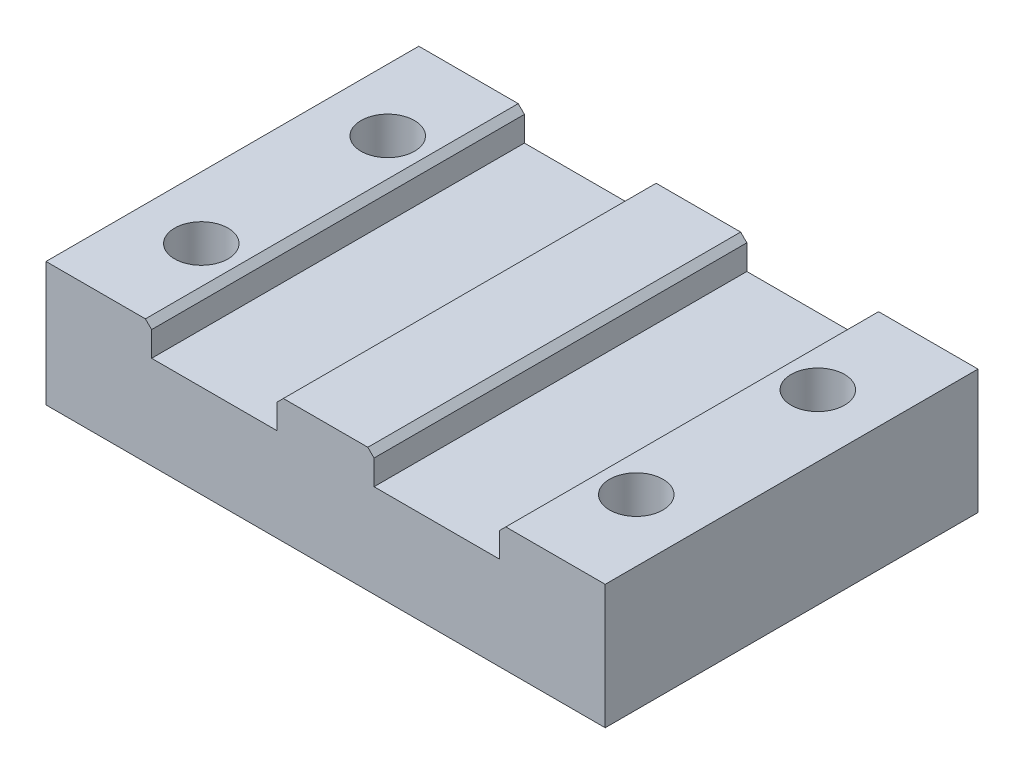
ISO-10303-21;
HEADER;
FILE_DESCRIPTION(('STEP AP214'),'2;1');
FILE_NAME('part.step','',(''),(''),'','','');
FILE_SCHEMA(('AUTOMOTIVE_DESIGN { 1 0 10303 214 1 1 1 1 }'));
ENDSEC;
DATA;
#1=APPLICATION_CONTEXT('core data for automotive mechanical design processes');
#2=APPLICATION_PROTOCOL_DEFINITION('international standard','automotive_design',2000,#1);
#3=PRODUCT_CONTEXT('',#1,'mechanical');
#4=PRODUCT('Part','Part','',(#3));
#5=PRODUCT_RELATED_PRODUCT_CATEGORY('part','',(#4));
#6=PRODUCT_DEFINITION_FORMATION('','',#4);
#7=PRODUCT_DEFINITION_CONTEXT('part definition',#1,'design');
#8=PRODUCT_DEFINITION('design','',#6,#7);
#9=PRODUCT_DEFINITION_SHAPE('','',#8);
#10=(LENGTH_UNIT() NAMED_UNIT(*) SI_UNIT(.MILLI.,.METRE.));
#11=(NAMED_UNIT(*) PLANE_ANGLE_UNIT() SI_UNIT($,.RADIAN.));
#12=(NAMED_UNIT(*) SI_UNIT($,.STERADIAN.) SOLID_ANGLE_UNIT());
#13=UNCERTAINTY_MEASURE_WITH_UNIT(LENGTH_MEASURE(1.E-05),#10,'distance_accuracy_value','');
#14=(GEOMETRIC_REPRESENTATION_CONTEXT(3) GLOBAL_UNCERTAINTY_ASSIGNED_CONTEXT((#13)) GLOBAL_UNIT_ASSIGNED_CONTEXT((#10,
#11,#12)) REPRESENTATION_CONTEXT('',''));
#15=CARTESIAN_POINT('',(0.,0.,0.));
#16=DIRECTION('',(0.,0.,1.));
#17=DIRECTION('',(1.,0.,0.));
#18=AXIS2_PLACEMENT_3D('',#15,#16,#17);
#19=CARTESIAN_POINT('',(-35.,20.,15.));
#20=DIRECTION('',(0.,-1.,0.));
#21=DIRECTION('',(0.,0.,-1.));
#22=AXIS2_PLACEMENT_3D('',#19,#20,#21);
#23=CYLINDRICAL_SURFACE('',#22,4.3);
#24=CARTESIAN_POINT('',(-35.,20.,15.));
#25=DIRECTION('',(0.,-1.,0.));
#26=DIRECTION('',(0.,0.,-1.));
#27=AXIS2_PLACEMENT_3D('',#24,#25,#26);
#28=CIRCLE('',#27,4.3);
#29=CARTESIAN_POINT('',(-35.,20.,10.7));
#30=VERTEX_POINT('',#29);
#31=EDGE_CURVE('E177',#30,#30,#28,.T.);
#32=ORIENTED_EDGE('',*,*,#31,.F.);
#33=EDGE_LOOP('',(#32));
#34=FACE_BOUND('',#33,.T.);
#35=CARTESIAN_POINT('',(-35.,10.,15.));
#36=DIRECTION('',(0.,-1.,0.));
#37=DIRECTION('',(0.,0.,-1.));
#38=AXIS2_PLACEMENT_3D('',#35,#36,#37);
#39=CIRCLE('',#38,4.3);
#40=CARTESIAN_POINT('',(-35.,10.,10.7));
#41=VERTEX_POINT('',#40);
#42=EDGE_CURVE('E253',#41,#41,#39,.F.);
#43=ORIENTED_EDGE('',*,*,#42,.F.);
#44=EDGE_LOOP('',(#43));
#45=FACE_BOUND('',#44,.T.);
#46=ADVANCED_FACE('F35',(#34,#45),#23,.F.);
#47=CARTESIAN_POINT('',(35.,20.,-14.2172732356869));
#48=DIRECTION('',(0.,-1.,0.));
#49=DIRECTION('',(0.,0.,-1.));
#50=AXIS2_PLACEMENT_3D('',#47,#48,#49);
#51=CYLINDRICAL_SURFACE('',#50,4.3);
#52=CARTESIAN_POINT('',(35.,20.,-14.2172732356869));
#53=DIRECTION('',(0.,-1.,0.));
#54=DIRECTION('',(0.,0.,-1.));
#55=AXIS2_PLACEMENT_3D('',#52,#53,#54);
#56=CIRCLE('',#55,4.3);
#57=CARTESIAN_POINT('',(35.,20.,-18.5172732356869));
#58=VERTEX_POINT('',#57);
#59=EDGE_CURVE('E612',#58,#58,#56,.T.);
#60=ORIENTED_EDGE('',*,*,#59,.F.);
#61=EDGE_LOOP('',(#60));
#62=FACE_BOUND('',#61,.T.);
#63=CARTESIAN_POINT('',(35.,10.,-14.2172732356869));
#64=DIRECTION('',(0.,-1.,0.));
#65=DIRECTION('',(0.,0.,-1.));
#66=AXIS2_PLACEMENT_3D('',#63,#64,#65);
#67=CIRCLE('',#66,4.3);
#68=CARTESIAN_POINT('',(35.,10.,-18.5172732356869));
#69=VERTEX_POINT('',#68);
#70=EDGE_CURVE('E249',#69,#69,#67,.F.);
#71=ORIENTED_EDGE('',*,*,#70,.F.);
#72=EDGE_LOOP('',(#71));
#73=FACE_BOUND('',#72,.T.);
#74=ADVANCED_FACE('F353',(#62,#73),#51,.F.);
#75=CARTESIAN_POINT('',(-35.,20.,-15.));
#76=DIRECTION('',(0.,-1.,0.));
#77=DIRECTION('',(0.,0.,-1.));
#78=AXIS2_PLACEMENT_3D('',#75,#76,#77);
#79=CYLINDRICAL_SURFACE('',#78,4.3);
#80=CARTESIAN_POINT('',(-35.,20.,-15.));
#81=DIRECTION('',(0.,-1.,0.));
#82=DIRECTION('',(0.,0.,-1.));
#83=AXIS2_PLACEMENT_3D('',#80,#81,#82);
#84=CIRCLE('',#83,4.3);
#85=CARTESIAN_POINT('',(-35.,20.,-19.3));
#86=VERTEX_POINT('',#85);
#87=EDGE_CURVE('E609',#86,#86,#84,.T.);
#88=ORIENTED_EDGE('',*,*,#87,.F.);
#89=EDGE_LOOP('',(#88));
#90=FACE_BOUND('',#89,.T.);
#91=CARTESIAN_POINT('',(-35.,10.,-15.));
#92=DIRECTION('',(0.,-1.,0.));
#93=DIRECTION('',(0.,0.,-1.));
#94=AXIS2_PLACEMENT_3D('',#91,#92,#93);
#95=CIRCLE('',#94,4.3);
#96=CARTESIAN_POINT('',(-35.,10.,-19.3));
#97=VERTEX_POINT('',#96);
#98=EDGE_CURVE('E246',#97,#97,#95,.F.);
#99=ORIENTED_EDGE('',*,*,#98,.F.);
#100=EDGE_LOOP('',(#99));
#101=FACE_BOUND('',#100,.T.);
#102=ADVANCED_FACE('F359',(#90,#101),#79,.F.);
#103=CARTESIAN_POINT('',(35.,20.,15.));
#104=DIRECTION('',(0.,-1.,0.));
#105=DIRECTION('',(0.,0.,-1.));
#106=AXIS2_PLACEMENT_3D('',#103,#104,#105);
#107=CYLINDRICAL_SURFACE('',#106,4.3);
#108=CARTESIAN_POINT('',(35.,20.,15.));
#109=DIRECTION('',(0.,-1.,0.));
#110=DIRECTION('',(0.,0.,-1.));
#111=AXIS2_PLACEMENT_3D('',#108,#109,#110);
#112=CIRCLE('',#111,4.3);
#113=CARTESIAN_POINT('',(35.,20.,10.7));
#114=VERTEX_POINT('',#113);
#115=EDGE_CURVE('E244',#114,#114,#112,.T.);
#116=ORIENTED_EDGE('',*,*,#115,.F.);
#117=EDGE_LOOP('',(#116));
#118=FACE_BOUND('',#117,.T.);
#119=CARTESIAN_POINT('',(35.,10.,15.));
#120=DIRECTION('',(0.,-1.,0.));
#121=DIRECTION('',(0.,0.,-1.));
#122=AXIS2_PLACEMENT_3D('',#119,#120,#121);
#123=CIRCLE('',#122,4.3);
#124=CARTESIAN_POINT('',(35.,10.,10.7));
#125=VERTEX_POINT('',#124);
#126=EDGE_CURVE('E241',#125,#125,#123,.F.);
#127=ORIENTED_EDGE('',*,*,#126,.F.);
#128=EDGE_LOOP('',(#127));
#129=FACE_BOUND('',#128,.T.);
#130=ADVANCED_FACE('F366',(#118,#129),#107,.F.);
#131=CARTESIAN_POINT('',(0.,20.,0.));
#132=DIRECTION('',(0.,1.,0.));
#133=DIRECTION('',(0.,0.,1.));
#134=AXIS2_PLACEMENT_3D('',#131,#132,#133);
#135=PLANE('',#134);
#136=ORIENTED_EDGE('',*,*,#59,.T.);
#137=EDGE_LOOP('',(#136));
#138=FACE_BOUND('',#137,.T.);
#139=ORIENTED_EDGE('',*,*,#115,.T.);
#140=EDGE_LOOP('',(#139));
#141=FACE_BOUND('',#140,.T.);
#142=DIRECTION('',(-1.,0.,0.));
#143=VECTOR('',#142,1.);
#144=CARTESIAN_POINT('',(45.,20.,-30.));
#145=LINE('',#144,#143);
#146=CARTESIAN_POINT('',(45.,20.,-30.));
#147=VERTEX_POINT('',#146);
#148=CARTESIAN_POINT('',(29.,20.,-30.));
#149=VERTEX_POINT('',#148);
#150=EDGE_CURVE('E217',#147,#149,#145,.T.);
#151=ORIENTED_EDGE('',*,*,#150,.T.);
#152=DIRECTION('',(0.,0.,1.));
#153=VECTOR('',#152,1.);
#154=CARTESIAN_POINT('',(29.,20.,30.));
#155=LINE('',#154,#153);
#156=CARTESIAN_POINT('',(29.,20.,30.));
#157=VERTEX_POINT('',#156);
#158=EDGE_CURVE('E11',#149,#157,#155,.T.);
#159=ORIENTED_EDGE('',*,*,#158,.T.);
#160=DIRECTION('',(1.,0.,0.));
#161=VECTOR('',#160,1.);
#162=CARTESIAN_POINT('',(45.,20.,30.));
#163=LINE('',#162,#161);
#164=CARTESIAN_POINT('',(45.,20.,30.));
#165=VERTEX_POINT('',#164);
#166=EDGE_CURVE('E208',#157,#165,#163,.T.);
#167=ORIENTED_EDGE('',*,*,#166,.T.);
#168=DIRECTION('',(0.,0.,-1.));
#169=VECTOR('',#168,1.);
#170=CARTESIAN_POINT('',(45.,20.,30.));
#171=LINE('',#170,#169);
#172=EDGE_CURVE('E213',#165,#147,#171,.T.);
#173=ORIENTED_EDGE('',*,*,#172,.T.);
#174=EDGE_LOOP('',(#151,#159,#167,#173));
#175=FACE_BOUND('',#174,.T.);
#176=ADVANCED_FACE('F305',(#138,#141,#175),#135,.T.);
#177=ORIENTED_EDGE('',*,*,#87,.T.);
#178=EDGE_LOOP('',(#177));
#179=FACE_BOUND('',#178,.T.);
#180=ORIENTED_EDGE('',*,*,#31,.T.);
#181=EDGE_LOOP('',(#180));
#182=FACE_BOUND('',#181,.T.);
#183=CARTESIAN_POINT('',(-45.,20.,30.));
#184=VERTEX_POINT('',#183);
#185=CARTESIAN_POINT('',(-29.,20.,30.));
#186=VERTEX_POINT('',#185);
#187=EDGE_CURVE('E210',#184,#186,#163,.T.);
#188=ORIENTED_EDGE('',*,*,#187,.T.);
#189=DIRECTION('',(0.,0.,-1.));
#190=VECTOR('',#189,1.);
#191=CARTESIAN_POINT('',(-29.,20.,-30.));
#192=LINE('',#191,#190);
#193=CARTESIAN_POINT('',(-29.,20.,-30.));
#194=VERTEX_POINT('',#193);
#195=EDGE_CURVE('E282',#186,#194,#192,.T.);
#196=ORIENTED_EDGE('',*,*,#195,.T.);
#197=CARTESIAN_POINT('',(-45.,20.,-30.));
#198=VERTEX_POINT('',#197);
#199=EDGE_CURVE('E216',#194,#198,#145,.T.);
#200=ORIENTED_EDGE('',*,*,#199,.T.);
#201=DIRECTION('',(0.,0.,1.));
#202=VECTOR('',#201,1.);
#203=CARTESIAN_POINT('',(-45.,20.,30.));
#204=LINE('',#203,#202);
#205=EDGE_CURVE('E205',#198,#184,#204,.T.);
#206=ORIENTED_EDGE('',*,*,#205,.T.);
#207=EDGE_LOOP('',(#188,#196,#200,#206));
#208=FACE_BOUND('',#207,.T.);
#209=ADVANCED_FACE('F379',(#179,#182,#208),#135,.T.);
#210=CARTESIAN_POINT('',(-45.,20.,30.));
#211=DIRECTION('',(1.,0.,0.));
#212=DIRECTION('',(0.,0.,-1.));
#213=AXIS2_PLACEMENT_3D('',#210,#211,#212);
#214=PLANE('',#213);
#215=DIRECTION('',(0.,0.,1.));
#216=VECTOR('',#215,1.);
#217=CARTESIAN_POINT('',(-45.,0.,30.));
#218=LINE('',#217,#216);
#219=CARTESIAN_POINT('',(-45.,0.,-30.));
#220=VERTEX_POINT('',#219);
#221=CARTESIAN_POINT('',(-45.,0.,30.));
#222=VERTEX_POINT('',#221);
#223=EDGE_CURVE('E200',#220,#222,#218,.T.);
#224=ORIENTED_EDGE('',*,*,#223,.T.);
#225=DIRECTION('',(0.,-1.,0.));
#226=VECTOR('',#225,1.);
#227=CARTESIAN_POINT('',(-45.,20.,30.));
#228=LINE('',#227,#226);
#229=EDGE_CURVE('E237',#184,#222,#228,.T.);
#230=ORIENTED_EDGE('',*,*,#229,.F.);
#231=ORIENTED_EDGE('',*,*,#205,.F.);
#232=DIRECTION('',(0.,-1.,0.));
#233=VECTOR('',#232,1.);
#234=CARTESIAN_POINT('',(-45.,20.,-30.));
#235=LINE('',#234,#233);
#236=EDGE_CURVE('E220',#198,#220,#235,.T.);
#237=ORIENTED_EDGE('',*,*,#236,.T.);
#238=EDGE_LOOP('',(#224,#230,#231,#237));
#239=FACE_BOUND('',#238,.T.);
#240=ADVANCED_FACE('F317',(#239),#214,.F.);
#241=CARTESIAN_POINT('',(45.,20.,30.));
#242=DIRECTION('',(0.,0.,-1.));
#243=DIRECTION('',(-1.,0.,0.));
#244=AXIS2_PLACEMENT_3D('',#241,#242,#243);
#245=PLANE('',#244);
#246=CARTESIAN_POINT('',(-6.79999999999997,20.,30.));
#247=VERTEX_POINT('',#246);
#248=CARTESIAN_POINT('',(6.80000000000004,20.,30.));
#249=VERTEX_POINT('',#248);
#250=EDGE_CURVE('E214',#247,#249,#163,.T.);
#251=ORIENTED_EDGE('',*,*,#250,.F.);
#252=DIRECTION('',(-0.707106781186548,-0.707106781186548,0.));
#253=VECTOR('',#252,1.);
#254=CARTESIAN_POINT('',(-6.79999999999998,20.,30.));
#255=LINE('',#254,#253);
#256=CARTESIAN_POINT('',(-7.79999999999999,19.,30.));
#257=VERTEX_POINT('',#256);
#258=EDGE_CURVE('E267',#247,#257,#255,.T.);
#259=ORIENTED_EDGE('',*,*,#258,.T.);
#260=DIRECTION('',(0.,1.,0.));
#261=VECTOR('',#260,1.);
#262=CARTESIAN_POINT('',(-7.8,20.,30.));
#263=LINE('',#262,#261);
#264=CARTESIAN_POINT('',(-7.79999999999999,15.,30.));
#265=VERTEX_POINT('',#264);
#266=EDGE_CURVE('E189',#265,#257,#263,.T.);
#267=ORIENTED_EDGE('',*,*,#266,.F.);
#268=DIRECTION('',(1.,0.,0.));
#269=VECTOR('',#268,1.);
#270=CARTESIAN_POINT('',(-7.79999999999999,15.,30.));
#271=LINE('',#270,#269);
#272=CARTESIAN_POINT('',(-28.,15.,30.));
#273=VERTEX_POINT('',#272);
#274=EDGE_CURVE('E155',#273,#265,#271,.T.);
#275=ORIENTED_EDGE('',*,*,#274,.F.);
#276=DIRECTION('',(0.,-1.,0.));
#277=VECTOR('',#276,1.);
#278=CARTESIAN_POINT('',(-28.,25.,30.));
#279=LINE('',#278,#277);
#280=CARTESIAN_POINT('',(-28.,19.,30.));
#281=VERTEX_POINT('',#280);
#282=EDGE_CURVE('E172',#281,#273,#279,.T.);
#283=ORIENTED_EDGE('',*,*,#282,.F.);
#284=DIRECTION('',(-0.707106781186548,0.707106781186548,0.));
#285=VECTOR('',#284,1.);
#286=CARTESIAN_POINT('',(-28.,19.,30.));
#287=LINE('',#286,#285);
#288=EDGE_CURVE('E263',#281,#186,#287,.T.);
#289=ORIENTED_EDGE('',*,*,#288,.T.);
#290=ORIENTED_EDGE('',*,*,#187,.F.);
#291=ORIENTED_EDGE('',*,*,#229,.T.);
#292=DIRECTION('',(1.,0.,0.));
#293=VECTOR('',#292,1.);
#294=CARTESIAN_POINT('',(45.,0.,30.));
#295=LINE('',#294,#293);
#296=CARTESIAN_POINT('',(45.,0.,30.));
#297=VERTEX_POINT('',#296);
#298=EDGE_CURVE('E224',#222,#297,#295,.T.);
#299=ORIENTED_EDGE('',*,*,#298,.T.);
#300=DIRECTION('',(0.,-1.,0.));
#301=VECTOR('',#300,1.);
#302=CARTESIAN_POINT('',(45.,20.,30.));
#303=LINE('',#302,#301);
#304=EDGE_CURVE('E234',#165,#297,#303,.T.);
#305=ORIENTED_EDGE('',*,*,#304,.F.);
#306=ORIENTED_EDGE('',*,*,#166,.F.);
#307=DIRECTION('',(-0.707106781186544,-0.707106781186551,0.));
#308=VECTOR('',#307,1.);
#309=CARTESIAN_POINT('',(28.,19.,30.));
#310=LINE('',#309,#308);
#311=CARTESIAN_POINT('',(28.,19.,30.));
#312=VERTEX_POINT('',#311);
#313=EDGE_CURVE('E261',#157,#312,#310,.T.);
#314=ORIENTED_EDGE('',*,*,#313,.T.);
#315=DIRECTION('',(0.,1.,0.));
#316=VECTOR('',#315,1.);
#317=CARTESIAN_POINT('',(28.,25.,30.));
#318=LINE('',#317,#316);
#319=CARTESIAN_POINT('',(28.,15.,30.));
#320=VERTEX_POINT('',#319);
#321=EDGE_CURVE('E174',#320,#312,#318,.T.);
#322=ORIENTED_EDGE('',*,*,#321,.F.);
#323=DIRECTION('',(1.,0.,0.));
#324=VECTOR('',#323,1.);
#325=CARTESIAN_POINT('',(28.,15.,30.));
#326=LINE('',#325,#324);
#327=CARTESIAN_POINT('',(7.80000000000001,15.,30.));
#328=VERTEX_POINT('',#327);
#329=EDGE_CURVE('E193',#328,#320,#326,.T.);
#330=ORIENTED_EDGE('',*,*,#329,.F.);
#331=DIRECTION('',(0.,-1.,0.));
#332=VECTOR('',#331,1.);
#333=CARTESIAN_POINT('',(7.80000000000001,15.,30.));
#334=LINE('',#333,#332);
#335=CARTESIAN_POINT('',(7.80000000000001,19.,30.));
#336=VERTEX_POINT('',#335);
#337=EDGE_CURVE('E191',#336,#328,#334,.T.);
#338=ORIENTED_EDGE('',*,*,#337,.F.);
#339=DIRECTION('',(-0.707106781186543,0.707106781186552,0.));
#340=VECTOR('',#339,1.);
#341=CARTESIAN_POINT('',(7.80000000000001,19.,30.));
#342=LINE('',#341,#340);
#343=EDGE_CURVE('E265',#336,#249,#342,.T.);
#344=ORIENTED_EDGE('',*,*,#343,.T.);
#345=EDGE_LOOP('',(#251,#259,#267,#275,#283,#289,#290,#291,#299,#305,#306,#314,#322,#330,#338,#344));
#346=FACE_BOUND('',#345,.T.);
#347=ADVANCED_FACE('F300',(#346),#245,.F.);
#348=CARTESIAN_POINT('',(45.,20.,30.));
#349=DIRECTION('',(-1.,0.,0.));
#350=DIRECTION('',(0.,0.,1.));
#351=AXIS2_PLACEMENT_3D('',#348,#349,#350);
#352=PLANE('',#351);
#353=DIRECTION('',(0.,0.,-1.));
#354=VECTOR('',#353,1.);
#355=CARTESIAN_POINT('',(45.,0.,30.));
#356=LINE('',#355,#354);
#357=CARTESIAN_POINT('',(45.,0.,-30.));
#358=VERTEX_POINT('',#357);
#359=EDGE_CURVE('E226',#297,#358,#356,.T.);
#360=ORIENTED_EDGE('',*,*,#359,.T.);
#361=DIRECTION('',(0.,-1.,0.));
#362=VECTOR('',#361,1.);
#363=CARTESIAN_POINT('',(45.,20.,-30.));
#364=LINE('',#363,#362);
#365=EDGE_CURVE('E231',#147,#358,#364,.T.);
#366=ORIENTED_EDGE('',*,*,#365,.F.);
#367=ORIENTED_EDGE('',*,*,#172,.F.);
#368=ORIENTED_EDGE('',*,*,#304,.T.);
#369=EDGE_LOOP('',(#360,#366,#367,#368));
#370=FACE_BOUND('',#369,.T.);
#371=ADVANCED_FACE('F385',(#370),#352,.F.);
#372=CARTESIAN_POINT('',(45.,20.,-30.));
#373=DIRECTION('',(0.,0.,1.));
#374=DIRECTION('',(1.,0.,0.));
#375=AXIS2_PLACEMENT_3D('',#372,#373,#374);
#376=PLANE('',#375);
#377=DIRECTION('',(0.,1.,0.));
#378=VECTOR('',#377,1.);
#379=CARTESIAN_POINT('',(-7.8,20.,-30.));
#380=LINE('',#379,#378);
#381=CARTESIAN_POINT('',(-7.79999999999999,15.,-30.));
#382=VERTEX_POINT('',#381);
#383=CARTESIAN_POINT('',(-7.79999999999999,19.,-30.));
#384=VERTEX_POINT('',#383);
#385=EDGE_CURVE('E163',#382,#384,#380,.T.);
#386=ORIENTED_EDGE('',*,*,#385,.T.);
#387=DIRECTION('',(0.707106781186548,0.707106781186548,0.));
#388=VECTOR('',#387,1.);
#389=CARTESIAN_POINT('',(-6.79999999999998,20.,-30.));
#390=LINE('',#389,#388);
#391=CARTESIAN_POINT('',(-6.79999999999997,20.,-30.));
#392=VERTEX_POINT('',#391);
#393=EDGE_CURVE('E274',#384,#392,#390,.T.);
#394=ORIENTED_EDGE('',*,*,#393,.T.);
#395=CARTESIAN_POINT('',(6.80000000000004,20.,-30.));
#396=VERTEX_POINT('',#395);
#397=EDGE_CURVE('E221',#396,#392,#145,.T.);
#398=ORIENTED_EDGE('',*,*,#397,.F.);
#399=DIRECTION('',(0.707106781186543,-0.707106781186552,0.));
#400=VECTOR('',#399,1.);
#401=CARTESIAN_POINT('',(7.80000000000001,19.,-30.));
#402=LINE('',#401,#400);
#403=CARTESIAN_POINT('',(7.80000000000001,19.,-30.));
#404=VERTEX_POINT('',#403);
#405=EDGE_CURVE('E50',#396,#404,#402,.T.);
#406=ORIENTED_EDGE('',*,*,#405,.T.);
#407=DIRECTION('',(0.,-1.,0.));
#408=VECTOR('',#407,1.);
#409=CARTESIAN_POINT('',(7.80000000000001,15.,-30.));
#410=LINE('',#409,#408);
#411=CARTESIAN_POINT('',(7.80000000000001,15.,-30.));
#412=VERTEX_POINT('',#411);
#413=EDGE_CURVE('E168',#404,#412,#410,.T.);
#414=ORIENTED_EDGE('',*,*,#413,.T.);
#415=DIRECTION('',(1.,0.,0.));
#416=VECTOR('',#415,1.);
#417=CARTESIAN_POINT('',(28.,15.,-30.));
#418=LINE('',#417,#416);
#419=CARTESIAN_POINT('',(28.,15.,-30.));
#420=VERTEX_POINT('',#419);
#421=EDGE_CURVE('E181',#412,#420,#418,.T.);
#422=ORIENTED_EDGE('',*,*,#421,.T.);
#423=DIRECTION('',(0.,1.,0.));
#424=VECTOR('',#423,1.);
#425=CARTESIAN_POINT('',(28.,25.,-30.));
#426=LINE('',#425,#424);
#427=CARTESIAN_POINT('',(28.,19.,-30.));
#428=VERTEX_POINT('',#427);
#429=EDGE_CURVE('E184',#420,#428,#426,.T.);
#430=ORIENTED_EDGE('',*,*,#429,.T.);
#431=DIRECTION('',(0.707106781186544,0.707106781186551,0.));
#432=VECTOR('',#431,1.);
#433=CARTESIAN_POINT('',(28.,19.,-30.));
#434=LINE('',#433,#432);
#435=EDGE_CURVE('E270',#428,#149,#434,.T.);
#436=ORIENTED_EDGE('',*,*,#435,.T.);
#437=ORIENTED_EDGE('',*,*,#150,.F.);
#438=ORIENTED_EDGE('',*,*,#365,.T.);
#439=DIRECTION('',(-1.,0.,0.));
#440=VECTOR('',#439,1.);
#441=CARTESIAN_POINT('',(45.,0.,-30.));
#442=LINE('',#441,#440);
#443=EDGE_CURVE('E209',#358,#220,#442,.T.);
#444=ORIENTED_EDGE('',*,*,#443,.T.);
#445=ORIENTED_EDGE('',*,*,#236,.F.);
#446=ORIENTED_EDGE('',*,*,#199,.F.);
#447=DIRECTION('',(0.707106781186548,-0.707106781186548,0.));
#448=VECTOR('',#447,1.);
#449=CARTESIAN_POINT('',(-28.,19.,-30.));
#450=LINE('',#449,#448);
#451=CARTESIAN_POINT('',(-28.,19.,-30.));
#452=VERTEX_POINT('',#451);
#453=EDGE_CURVE('E57',#194,#452,#450,.T.);
#454=ORIENTED_EDGE('',*,*,#453,.T.);
#455=DIRECTION('',(0.,-1.,0.));
#456=VECTOR('',#455,1.);
#457=CARTESIAN_POINT('',(-28.,25.,-30.));
#458=LINE('',#457,#456);
#459=CARTESIAN_POINT('',(-28.,15.,-30.));
#460=VERTEX_POINT('',#459);
#461=EDGE_CURVE('E160',#452,#460,#458,.T.);
#462=ORIENTED_EDGE('',*,*,#461,.T.);
#463=DIRECTION('',(1.,0.,0.));
#464=VECTOR('',#463,1.);
#465=CARTESIAN_POINT('',(-7.79999999999999,15.,-30.));
#466=LINE('',#465,#464);
#467=EDGE_CURVE('E153',#460,#382,#466,.T.);
#468=ORIENTED_EDGE('',*,*,#467,.T.);
#469=EDGE_LOOP('',(#386,#394,#398,#406,#414,#422,#430,#436,#437,#438,#444,#445,#446,#454,#462,#468));
#470=FACE_BOUND('',#469,.T.);
#471=ADVANCED_FACE('F170',(#470),#376,.F.);
#472=ORIENTED_EDGE('',*,*,#397,.T.);
#473=DIRECTION('',(0.,0.,1.));
#474=VECTOR('',#473,1.);
#475=CARTESIAN_POINT('',(-6.79999999999998,20.,30.));
#476=LINE('',#475,#474);
#477=EDGE_CURVE('E258',#392,#247,#476,.T.);
#478=ORIENTED_EDGE('',*,*,#477,.T.);
#479=ORIENTED_EDGE('',*,*,#250,.T.);
#480=DIRECTION('',(0.,0.,-1.));
#481=VECTOR('',#480,1.);
#482=CARTESIAN_POINT('',(6.80000000000002,20.,-30.));
#483=LINE('',#482,#481);
#484=EDGE_CURVE('E240',#249,#396,#483,.T.);
#485=ORIENTED_EDGE('',*,*,#484,.T.);
#486=EDGE_LOOP('',(#472,#478,#479,#485));
#487=FACE_BOUND('',#486,.T.);
#488=ADVANCED_FACE('F332',(#487),#135,.T.);
#489=CARTESIAN_POINT('',(0.,0.,0.));
#490=DIRECTION('',(0.,1.,0.));
#491=DIRECTION('',(0.,0.,1.));
#492=AXIS2_PLACEMENT_3D('',#489,#490,#491);
#493=PLANE('',#492);
#494=CARTESIAN_POINT('',(35.,0.,-14.2172732356869));
#495=DIRECTION('',(0.,-1.,0.));
#496=DIRECTION('',(0.,0.,-1.));
#497=AXIS2_PLACEMENT_3D('',#494,#495,#496);
#498=CIRCLE('',#497,8.8);
#499=CARTESIAN_POINT('',(35.,0.,-23.0172732356869));
#500=VERTEX_POINT('',#499);
#501=EDGE_CURVE('E640',#500,#500,#498,.T.);
#502=ORIENTED_EDGE('',*,*,#501,.F.);
#503=EDGE_LOOP('',(#502));
#504=FACE_BOUND('',#503,.T.);
#505=CARTESIAN_POINT('',(-35.,0.,15.));
#506=DIRECTION('',(0.,-1.,0.));
#507=DIRECTION('',(0.,0.,-1.));
#508=AXIS2_PLACEMENT_3D('',#505,#506,#507);
#509=CIRCLE('',#508,8.8);
#510=CARTESIAN_POINT('',(-35.,0.,6.2));
#511=VERTEX_POINT('',#510);
#512=EDGE_CURVE('E634',#511,#511,#509,.T.);
#513=ORIENTED_EDGE('',*,*,#512,.F.);
#514=EDGE_LOOP('',(#513));
#515=FACE_BOUND('',#514,.T.);
#516=CARTESIAN_POINT('',(-35.,0.,-15.));
#517=DIRECTION('',(0.,-1.,0.));
#518=DIRECTION('',(0.,0.,-1.));
#519=AXIS2_PLACEMENT_3D('',#516,#517,#518);
#520=CIRCLE('',#519,8.8);
#521=CARTESIAN_POINT('',(-35.,0.,-23.8));
#522=VERTEX_POINT('',#521);
#523=EDGE_CURVE('E628',#522,#522,#520,.T.);
#524=ORIENTED_EDGE('',*,*,#523,.F.);
#525=EDGE_LOOP('',(#524));
#526=FACE_BOUND('',#525,.T.);
#527=CARTESIAN_POINT('',(35.,0.,15.));
#528=DIRECTION('',(0.,-1.,0.));
#529=DIRECTION('',(0.,0.,-1.));
#530=AXIS2_PLACEMENT_3D('',#527,#528,#529);
#531=CIRCLE('',#530,8.8);
#532=CARTESIAN_POINT('',(35.,0.,6.2));
#533=VERTEX_POINT('',#532);
#534=EDGE_CURVE('E256',#533,#533,#531,.T.);
#535=ORIENTED_EDGE('',*,*,#534,.F.);
#536=EDGE_LOOP('',(#535));
#537=FACE_BOUND('',#536,.T.);
#538=ORIENTED_EDGE('',*,*,#223,.F.);
#539=ORIENTED_EDGE('',*,*,#443,.F.);
#540=ORIENTED_EDGE('',*,*,#359,.F.);
#541=ORIENTED_EDGE('',*,*,#298,.F.);
#542=EDGE_LOOP('',(#538,#539,#540,#541));
#543=FACE_BOUND('',#542,.T.);
#544=ADVANCED_FACE('F314',(#504,#515,#526,#537,#543),#493,.F.);
#545=CARTESIAN_POINT('',(-7.8,20.,-30.));
#546=DIRECTION('',(1.,0.,0.));
#547=DIRECTION('',(0.,1.,0.));
#548=AXIS2_PLACEMENT_3D('',#545,#546,#547);
#549=PLANE('',#548);
#550=ORIENTED_EDGE('',*,*,#266,.T.);
#551=DIRECTION('',(0.,0.,-1.));
#552=VECTOR('',#551,1.);
#553=CARTESIAN_POINT('',(-7.79999999999999,19.,-30.));
#554=LINE('',#553,#552);
#555=EDGE_CURVE('E166',#257,#384,#554,.T.);
#556=ORIENTED_EDGE('',*,*,#555,.T.);
#557=ORIENTED_EDGE('',*,*,#385,.F.);
#558=DIRECTION('',(0.,0.,1.));
#559=VECTOR('',#558,1.);
#560=CARTESIAN_POINT('',(-7.79999999999999,15.,-30.));
#561=LINE('',#560,#559);
#562=EDGE_CURVE('E148',#382,#265,#561,.T.);
#563=ORIENTED_EDGE('',*,*,#562,.T.);
#564=EDGE_LOOP('',(#550,#556,#557,#563));
#565=FACE_BOUND('',#564,.T.);
#566=ADVANCED_FACE('F164',(#565),#549,.F.);
#567=CARTESIAN_POINT('',(-28.,25.,-30.));
#568=DIRECTION('',(-1.,0.,0.));
#569=DIRECTION('',(0.,-1.,0.));
#570=AXIS2_PLACEMENT_3D('',#567,#568,#569);
#571=PLANE('',#570);
#572=ORIENTED_EDGE('',*,*,#461,.F.);
#573=DIRECTION('',(0.,0.,1.));
#574=VECTOR('',#573,1.);
#575=CARTESIAN_POINT('',(-28.,19.,30.));
#576=LINE('',#575,#574);
#577=EDGE_CURVE('E279',#452,#281,#576,.T.);
#578=ORIENTED_EDGE('',*,*,#577,.T.);
#579=ORIENTED_EDGE('',*,*,#282,.T.);
#580=DIRECTION('',(0.,0.,1.));
#581=VECTOR('',#580,1.);
#582=CARTESIAN_POINT('',(-28.,15.,-30.));
#583=LINE('',#582,#581);
#584=EDGE_CURVE('E198',#460,#273,#583,.T.);
#585=ORIENTED_EDGE('',*,*,#584,.F.);
#586=EDGE_LOOP('',(#572,#578,#579,#585));
#587=FACE_BOUND('',#586,.T.);
#588=ADVANCED_FACE('F326',(#587),#571,.F.);
#589=CARTESIAN_POINT('',(-7.79999999999999,15.,-30.));
#590=DIRECTION('',(0.,-1.,0.));
#591=DIRECTION('',(0.,0.,-1.));
#592=AXIS2_PLACEMENT_3D('',#589,#590,#591);
#593=PLANE('',#592);
#594=ORIENTED_EDGE('',*,*,#274,.T.);
#595=ORIENTED_EDGE('',*,*,#562,.F.);
#596=ORIENTED_EDGE('',*,*,#467,.F.);
#597=ORIENTED_EDGE('',*,*,#584,.T.);
#598=EDGE_LOOP('',(#594,#595,#596,#597));
#599=FACE_BOUND('',#598,.T.);
#600=ADVANCED_FACE('F150',(#599),#593,.F.);
#601=CARTESIAN_POINT('',(28.,25.,-30.));
#602=DIRECTION('',(1.,0.,0.));
#603=DIRECTION('',(0.,1.,0.));
#604=AXIS2_PLACEMENT_3D('',#601,#602,#603);
#605=PLANE('',#604);
#606=ORIENTED_EDGE('',*,*,#321,.T.);
#607=DIRECTION('',(0.,0.,-1.));
#608=VECTOR('',#607,1.);
#609=CARTESIAN_POINT('',(28.,19.,-30.));
#610=LINE('',#609,#608);
#611=EDGE_CURVE('E43',#312,#428,#610,.T.);
#612=ORIENTED_EDGE('',*,*,#611,.T.);
#613=ORIENTED_EDGE('',*,*,#429,.F.);
#614=DIRECTION('',(0.,0.,1.));
#615=VECTOR('',#614,1.);
#616=CARTESIAN_POINT('',(28.,15.,-30.));
#617=LINE('',#616,#615);
#618=EDGE_CURVE('E201',#420,#320,#617,.T.);
#619=ORIENTED_EDGE('',*,*,#618,.T.);
#620=EDGE_LOOP('',(#606,#612,#613,#619));
#621=FACE_BOUND('',#620,.T.);
#622=ADVANCED_FACE('F287',(#621),#605,.F.);
#623=CARTESIAN_POINT('',(28.,15.,-30.));
#624=DIRECTION('',(0.,-1.,0.));
#625=DIRECTION('',(1.,0.,0.));
#626=AXIS2_PLACEMENT_3D('',#623,#624,#625);
#627=PLANE('',#626);
#628=ORIENTED_EDGE('',*,*,#329,.T.);
#629=ORIENTED_EDGE('',*,*,#618,.F.);
#630=ORIENTED_EDGE('',*,*,#421,.F.);
#631=DIRECTION('',(0.,0.,1.));
#632=VECTOR('',#631,1.);
#633=CARTESIAN_POINT('',(7.80000000000001,15.,-30.));
#634=LINE('',#633,#632);
#635=EDGE_CURVE('E159',#412,#328,#634,.T.);
#636=ORIENTED_EDGE('',*,*,#635,.T.);
#637=EDGE_LOOP('',(#628,#629,#630,#636));
#638=FACE_BOUND('',#637,.T.);
#639=ADVANCED_FACE('F295',(#638),#627,.F.);
#640=CARTESIAN_POINT('',(7.80000000000001,15.,-30.));
#641=DIRECTION('',(-1.,0.,0.));
#642=DIRECTION('',(0.,-1.,0.));
#643=AXIS2_PLACEMENT_3D('',#640,#641,#642);
#644=PLANE('',#643);
#645=ORIENTED_EDGE('',*,*,#413,.F.);
#646=DIRECTION('',(0.,0.,1.));
#647=VECTOR('',#646,1.);
#648=CARTESIAN_POINT('',(7.80000000000001,19.,30.));
#649=LINE('',#648,#647);
#650=EDGE_CURVE('E276',#404,#336,#649,.T.);
#651=ORIENTED_EDGE('',*,*,#650,.T.);
#652=ORIENTED_EDGE('',*,*,#337,.T.);
#653=ORIENTED_EDGE('',*,*,#635,.F.);
#654=EDGE_LOOP('',(#645,#651,#652,#653));
#655=FACE_BOUND('',#654,.T.);
#656=ADVANCED_FACE('F339',(#655),#644,.F.);
#657=CARTESIAN_POINT('',(35.,10.,15.));
#658=DIRECTION('',(0.,-1.,0.));
#659=DIRECTION('',(0.,0.,-1.));
#660=AXIS2_PLACEMENT_3D('',#657,#658,#659);
#661=PLANE('',#660);
#662=CARTESIAN_POINT('',(35.,10.,15.));
#663=DIRECTION('',(0.,-1.,0.));
#664=DIRECTION('',(0.,0.,-1.));
#665=AXIS2_PLACEMENT_3D('',#662,#663,#664);
#666=CIRCLE('',#665,8.8);
#667=CARTESIAN_POINT('',(35.,10.,6.2));
#668=VERTEX_POINT('',#667);
#669=EDGE_CURVE('E245',#668,#668,#666,.T.);
#670=ORIENTED_EDGE('',*,*,#669,.T.);
#671=EDGE_LOOP('',(#670));
#672=FACE_BOUND('',#671,.T.);
#673=ORIENTED_EDGE('',*,*,#126,.T.);
#674=EDGE_LOOP('',(#673));
#675=FACE_BOUND('',#674,.T.);
#676=ADVANCED_FACE('F341',(#672,#675),#661,.T.);
#677=CARTESIAN_POINT('',(35.,10.,15.));
#678=DIRECTION('',(0.,-1.,0.));
#679=DIRECTION('',(0.,0.,-1.));
#680=AXIS2_PLACEMENT_3D('',#677,#678,#679);
#681=CYLINDRICAL_SURFACE('',#680,8.8);
#682=ORIENTED_EDGE('',*,*,#669,.F.);
#683=EDGE_LOOP('',(#682));
#684=FACE_BOUND('',#683,.T.);
#685=ORIENTED_EDGE('',*,*,#534,.T.);
#686=EDGE_LOOP('',(#685));
#687=FACE_BOUND('',#686,.T.);
#688=ADVANCED_FACE('F347',(#684,#687),#681,.F.);
#689=CARTESIAN_POINT('',(-35.,10.,-15.));
#690=DIRECTION('',(0.,-1.,0.));
#691=DIRECTION('',(0.,0.,-1.));
#692=AXIS2_PLACEMENT_3D('',#689,#690,#691);
#693=PLANE('',#692);
#694=CARTESIAN_POINT('',(-35.,10.,-15.));
#695=DIRECTION('',(0.,-1.,0.));
#696=DIRECTION('',(0.,0.,-1.));
#697=AXIS2_PLACEMENT_3D('',#694,#695,#696);
#698=CIRCLE('',#697,8.8);
#699=CARTESIAN_POINT('',(-35.,10.,-23.8));
#700=VERTEX_POINT('',#699);
#701=EDGE_CURVE('E631',#700,#700,#698,.T.);
#702=ORIENTED_EDGE('',*,*,#701,.T.);
#703=EDGE_LOOP('',(#702));
#704=FACE_BOUND('',#703,.T.);
#705=ORIENTED_EDGE('',*,*,#98,.T.);
#706=EDGE_LOOP('',(#705));
#707=FACE_BOUND('',#706,.T.);
#708=ADVANCED_FACE('F529',(#704,#707),#693,.T.);
#709=CARTESIAN_POINT('',(-35.,10.,-15.));
#710=DIRECTION('',(0.,-1.,0.));
#711=DIRECTION('',(0.,0.,-1.));
#712=AXIS2_PLACEMENT_3D('',#709,#710,#711);
#713=CYLINDRICAL_SURFACE('',#712,8.8);
#714=ORIENTED_EDGE('',*,*,#701,.F.);
#715=EDGE_LOOP('',(#714));
#716=FACE_BOUND('',#715,.T.);
#717=ORIENTED_EDGE('',*,*,#523,.T.);
#718=EDGE_LOOP('',(#717));
#719=FACE_BOUND('',#718,.T.);
#720=ADVANCED_FACE('F519',(#716,#719),#713,.F.);
#721=CARTESIAN_POINT('',(35.,10.,-14.2172732356869));
#722=DIRECTION('',(0.,-1.,0.));
#723=DIRECTION('',(0.,0.,-1.));
#724=AXIS2_PLACEMENT_3D('',#721,#722,#723);
#725=PLANE('',#724);
#726=CARTESIAN_POINT('',(35.,10.,-14.2172732356869));
#727=DIRECTION('',(0.,-1.,0.));
#728=DIRECTION('',(0.,0.,-1.));
#729=AXIS2_PLACEMENT_3D('',#726,#727,#728);
#730=CIRCLE('',#729,8.8);
#731=CARTESIAN_POINT('',(35.,10.,-23.0172732356869));
#732=VERTEX_POINT('',#731);
#733=EDGE_CURVE('E250',#732,#732,#730,.T.);
#734=ORIENTED_EDGE('',*,*,#733,.T.);
#735=EDGE_LOOP('',(#734));
#736=FACE_BOUND('',#735,.T.);
#737=ORIENTED_EDGE('',*,*,#70,.T.);
#738=EDGE_LOOP('',(#737));
#739=FACE_BOUND('',#738,.T.);
#740=ADVANCED_FACE('F509',(#736,#739),#725,.T.);
#741=CARTESIAN_POINT('',(35.,10.,-14.2172732356869));
#742=DIRECTION('',(0.,-1.,0.));
#743=DIRECTION('',(0.,0.,-1.));
#744=AXIS2_PLACEMENT_3D('',#741,#742,#743);
#745=CYLINDRICAL_SURFACE('',#744,8.8);
#746=ORIENTED_EDGE('',*,*,#733,.F.);
#747=EDGE_LOOP('',(#746));
#748=FACE_BOUND('',#747,.T.);
#749=ORIENTED_EDGE('',*,*,#501,.T.);
#750=EDGE_LOOP('',(#749));
#751=FACE_BOUND('',#750,.T.);
#752=ADVANCED_FACE('F499',(#748,#751),#745,.F.);
#753=CARTESIAN_POINT('',(-35.,10.,15.));
#754=DIRECTION('',(0.,-1.,0.));
#755=DIRECTION('',(0.,0.,-1.));
#756=AXIS2_PLACEMENT_3D('',#753,#754,#755);
#757=PLANE('',#756);
#758=CARTESIAN_POINT('',(-35.,10.,15.));
#759=DIRECTION('',(0.,-1.,0.));
#760=DIRECTION('',(0.,0.,-1.));
#761=AXIS2_PLACEMENT_3D('',#758,#759,#760);
#762=CIRCLE('',#761,8.8);
#763=CARTESIAN_POINT('',(-35.,10.,6.2));
#764=VERTEX_POINT('',#763);
#765=EDGE_CURVE('E637',#764,#764,#762,.T.);
#766=ORIENTED_EDGE('',*,*,#765,.T.);
#767=EDGE_LOOP('',(#766));
#768=FACE_BOUND('',#767,.T.);
#769=ORIENTED_EDGE('',*,*,#42,.T.);
#770=EDGE_LOOP('',(#769));
#771=FACE_BOUND('',#770,.T.);
#772=ADVANCED_FACE('F489',(#768,#771),#757,.T.);
#773=CARTESIAN_POINT('',(-35.,10.,15.));
#774=DIRECTION('',(0.,-1.,0.));
#775=DIRECTION('',(0.,0.,-1.));
#776=AXIS2_PLACEMENT_3D('',#773,#774,#775);
#777=CYLINDRICAL_SURFACE('',#776,8.8);
#778=ORIENTED_EDGE('',*,*,#765,.F.);
#779=EDGE_LOOP('',(#778));
#780=FACE_BOUND('',#779,.T.);
#781=ORIENTED_EDGE('',*,*,#512,.T.);
#782=EDGE_LOOP('',(#781));
#783=FACE_BOUND('',#782,.T.);
#784=ADVANCED_FACE('F394',(#780,#783),#777,.F.);
#785=CARTESIAN_POINT('',(-6.79999999999998,20.,0.));
#786=DIRECTION('',(-0.707106781186547,0.707106781186547,0.));
#787=DIRECTION('',(0.,0.,-1.));
#788=AXIS2_PLACEMENT_3D('',#785,#786,#787);
#789=PLANE('',#788);
#790=ORIENTED_EDGE('',*,*,#393,.F.);
#791=ORIENTED_EDGE('',*,*,#555,.F.);
#792=ORIENTED_EDGE('',*,*,#258,.F.);
#793=ORIENTED_EDGE('',*,*,#477,.F.);
#794=EDGE_LOOP('',(#790,#791,#792,#793));
#795=FACE_BOUND('',#794,.T.);
#796=ADVANCED_FACE('F328',(#795),#789,.T.);
#797=CARTESIAN_POINT('',(7.80000000000001,19.,-30.));
#798=DIRECTION('',(0.707106781186552,0.707106781186543,0.));
#799=DIRECTION('',(0.,0.,-1.));
#800=AXIS2_PLACEMENT_3D('',#797,#798,#799);
#801=PLANE('',#800);
#802=ORIENTED_EDGE('',*,*,#405,.F.);
#803=ORIENTED_EDGE('',*,*,#484,.F.);
#804=ORIENTED_EDGE('',*,*,#343,.F.);
#805=ORIENTED_EDGE('',*,*,#650,.F.);
#806=EDGE_LOOP('',(#802,#803,#804,#805));
#807=FACE_BOUND('',#806,.T.);
#808=ADVANCED_FACE('F336',(#807),#801,.T.);
#809=CARTESIAN_POINT('',(-28.,19.,-30.));
#810=DIRECTION('',(0.707106781186547,0.707106781186547,0.));
#811=DIRECTION('',(0.,0.,-1.));
#812=AXIS2_PLACEMENT_3D('',#809,#810,#811);
#813=PLANE('',#812);
#814=ORIENTED_EDGE('',*,*,#453,.F.);
#815=ORIENTED_EDGE('',*,*,#195,.F.);
#816=ORIENTED_EDGE('',*,*,#288,.F.);
#817=ORIENTED_EDGE('',*,*,#577,.F.);
#818=EDGE_LOOP('',(#814,#815,#816,#817));
#819=FACE_BOUND('',#818,.T.);
#820=ADVANCED_FACE('F323',(#819),#813,.T.);
#821=CARTESIAN_POINT('',(28.,19.,-30.));
#822=DIRECTION('',(-0.707106781186551,0.707106781186544,0.));
#823=DIRECTION('',(0.,0.,1.));
#824=AXIS2_PLACEMENT_3D('',#821,#822,#823);
#825=PLANE('',#824);
#826=ORIENTED_EDGE('',*,*,#313,.F.);
#827=ORIENTED_EDGE('',*,*,#158,.F.);
#828=ORIENTED_EDGE('',*,*,#435,.F.);
#829=ORIENTED_EDGE('',*,*,#611,.F.);
#830=EDGE_LOOP('',(#826,#827,#828,#829));
#831=FACE_BOUND('',#830,.T.);
#832=ADVANCED_FACE('F37',(#831),#825,.T.);
#833=CLOSED_SHELL('',(#46,#74,#102,#130,#176,#209,#240,#347,#371,#471,#488,#544,#566,#588,#600,
#622,#639,#656,#676,#688,#708,#720,#740,#752,#772,#784,#796,#808,#820,#832));
#834=MANIFOLD_SOLID_BREP('B2',#833);
#835=ADVANCED_BREP_SHAPE_REPRESENTATION('',(#18,#834),#14);
#836=SHAPE_DEFINITION_REPRESENTATION(#9,#835);
ENDSEC;
END-ISO-10303-21;
